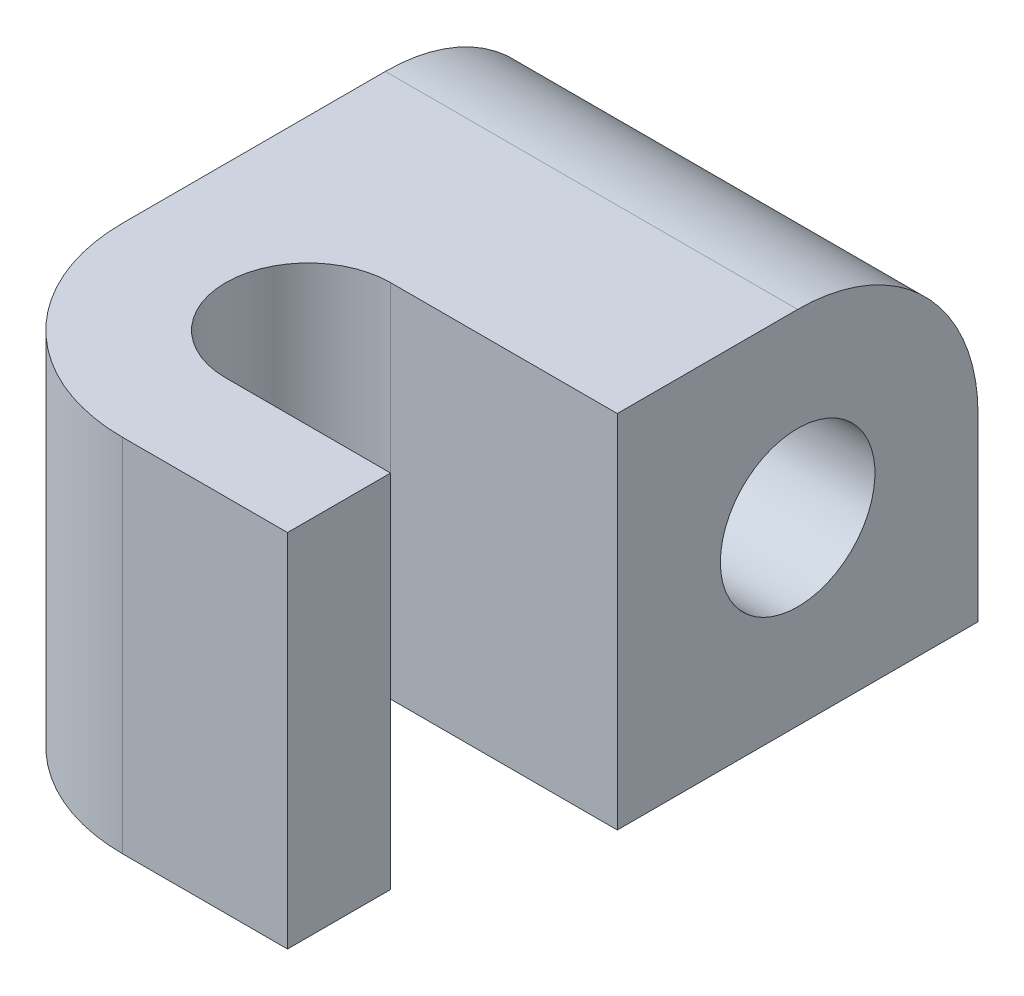
ISO-10303-21;
HEADER;
FILE_DESCRIPTION(('STEP AP214'),'2;1');
FILE_NAME('part.step','',(''),(''),'','','');
FILE_SCHEMA(('AUTOMOTIVE_DESIGN { 1 0 10303 214 1 1 1 1 }'));
ENDSEC;
DATA;
#1=APPLICATION_CONTEXT('core data for automotive mechanical design processes');
#2=APPLICATION_PROTOCOL_DEFINITION('international standard','automotive_design',2000,#1);
#3=PRODUCT_CONTEXT('',#1,'mechanical');
#4=PRODUCT('Part','Part','',(#3));
#5=PRODUCT_RELATED_PRODUCT_CATEGORY('part','',(#4));
#6=PRODUCT_DEFINITION_FORMATION('','',#4);
#7=PRODUCT_DEFINITION_CONTEXT('part definition',#1,'design');
#8=PRODUCT_DEFINITION('design','',#6,#7);
#9=PRODUCT_DEFINITION_SHAPE('','',#8);
#10=(LENGTH_UNIT() NAMED_UNIT(*) SI_UNIT(.MILLI.,.METRE.));
#11=(NAMED_UNIT(*) PLANE_ANGLE_UNIT() SI_UNIT($,.RADIAN.));
#12=(NAMED_UNIT(*) SI_UNIT($,.STERADIAN.) SOLID_ANGLE_UNIT());
#13=UNCERTAINTY_MEASURE_WITH_UNIT(LENGTH_MEASURE(1.E-05),#10,'distance_accuracy_value','');
#14=(GEOMETRIC_REPRESENTATION_CONTEXT(3) GLOBAL_UNCERTAINTY_ASSIGNED_CONTEXT((#13)) GLOBAL_UNIT_ASSIGNED_CONTEXT((#10,
#11,#12)) REPRESENTATION_CONTEXT('',''));
#15=CARTESIAN_POINT('',(0.,0.,0.));
#16=DIRECTION('',(0.,0.,1.));
#17=DIRECTION('',(1.,0.,0.));
#18=AXIS2_PLACEMENT_3D('',#15,#16,#17);
#19=CARTESIAN_POINT('',(20.,8.75,8.75));
#20=DIRECTION('',(0.,0.,-1.));
#21=DIRECTION('',(0.,1.,0.));
#22=AXIS2_PLACEMENT_3D('',#19,#20,#21);
#23=PLANE('',#22);
#24=DIRECTION('',(0.,-1.,0.));
#25=VECTOR('',#24,1.);
#26=CARTESIAN_POINT('',(9.,17.5,8.75));
#27=LINE('',#26,#25);
#28=CARTESIAN_POINT('',(9.,17.5,8.75));
#29=VERTEX_POINT('',#28);
#30=CARTESIAN_POINT('',(9.,0.,8.75));
#31=VERTEX_POINT('',#30);
#32=EDGE_CURVE('E47',#29,#31,#27,.T.);
#33=ORIENTED_EDGE('',*,*,#32,.T.);
#34=DIRECTION('',(-1.,0.,0.));
#35=VECTOR('',#34,1.);
#36=CARTESIAN_POINT('',(20.,0.,8.75));
#37=LINE('',#36,#35);
#38=CARTESIAN_POINT('',(20.,0.,8.75));
#39=VERTEX_POINT('',#38);
#40=EDGE_CURVE('E11',#39,#31,#37,.T.);
#41=ORIENTED_EDGE('',*,*,#40,.F.);
#42=DIRECTION('',(0.,-1.,0.));
#43=VECTOR('',#42,1.);
#44=CARTESIAN_POINT('',(20.,8.75,8.75));
#45=LINE('',#44,#43);
#46=CARTESIAN_POINT('',(20.,17.5,8.75));
#47=VERTEX_POINT('',#46);
#48=EDGE_CURVE('E116',#47,#39,#45,.T.);
#49=ORIENTED_EDGE('',*,*,#48,.F.);
#50=DIRECTION('',(-1.,0.,0.));
#51=VECTOR('',#50,1.);
#52=CARTESIAN_POINT('',(9.,17.5,8.75));
#53=LINE('',#52,#51);
#54=EDGE_CURVE('E143',#47,#29,#53,.T.);
#55=ORIENTED_EDGE('',*,*,#54,.T.);
#56=EDGE_LOOP('',(#33,#41,#49,#55));
#57=FACE_BOUND('',#56,.T.);
#58=ADVANCED_FACE('F33',(#57),#23,.F.);
#59=CARTESIAN_POINT('',(20.,8.75,0.));
#60=DIRECTION('',(-1.,0.,0.));
#61=DIRECTION('',(0.,0.,1.));
#62=AXIS2_PLACEMENT_3D('',#59,#60,#61);
#63=CYLINDRICAL_SURFACE('',#62,8.75);
#64=DIRECTION('',(1.,0.,0.));
#65=VECTOR('',#64,1.);
#66=CARTESIAN_POINT('',(20.,17.5,0.));
#67=LINE('',#66,#65);
#68=CARTESIAN_POINT('',(0.,17.5,0.));
#69=VERTEX_POINT('',#68);
#70=CARTESIAN_POINT('',(20.,17.5,0.));
#71=VERTEX_POINT('',#70);
#72=EDGE_CURVE('E54',#69,#71,#67,.T.);
#73=ORIENTED_EDGE('',*,*,#72,.T.);
#74=CARTESIAN_POINT('',(20.,8.75,0.));
#75=DIRECTION('',(1.,0.,0.));
#76=DIRECTION('',(0.,0.,-1.));
#77=AXIS2_PLACEMENT_3D('',#74,#75,#76);
#78=CIRCLE('',#77,8.75);
#79=CARTESIAN_POINT('',(20.,8.75,-8.75));
#80=VERTEX_POINT('',#79);
#81=EDGE_CURVE('E188',#80,#71,#78,.T.);
#82=ORIENTED_EDGE('',*,*,#81,.F.);
#83=DIRECTION('',(-1.,0.,0.));
#84=VECTOR('',#83,1.);
#85=CARTESIAN_POINT('',(20.,8.75,-8.75));
#86=LINE('',#85,#84);
#87=CARTESIAN_POINT('',(0.,8.75,-8.75));
#88=VERTEX_POINT('',#87);
#89=EDGE_CURVE('E112',#80,#88,#86,.T.);
#90=ORIENTED_EDGE('',*,*,#89,.T.);
#91=CARTESIAN_POINT('',(0.,8.75,0.));
#92=DIRECTION('',(1.,0.,0.));
#93=DIRECTION('',(0.,0.,-1.));
#94=AXIS2_PLACEMENT_3D('',#91,#92,#93);
#95=CIRCLE('',#94,8.75);
#96=EDGE_CURVE('E109',#88,#69,#95,.T.);
#97=ORIENTED_EDGE('',*,*,#96,.T.);
#98=EDGE_LOOP('',(#73,#82,#90,#97));
#99=FACE_BOUND('',#98,.T.);
#100=ADVANCED_FACE('F110',(#99),#63,.T.);
#101=CARTESIAN_POINT('',(20.,0.,8.75));
#102=DIRECTION('',(0.,1.,0.));
#103=DIRECTION('',(0.,0.,1.));
#104=AXIS2_PLACEMENT_3D('',#101,#102,#103);
#105=PLANE('',#104);
#106=DIRECTION('',(-1.,0.,0.));
#107=VECTOR('',#106,1.);
#108=CARTESIAN_POINT('',(20.,0.,-8.75));
#109=LINE('',#108,#107);
#110=CARTESIAN_POINT('',(20.,0.,-8.75));
#111=VERTEX_POINT('',#110);
#112=CARTESIAN_POINT('',(0.,0.,-8.75));
#113=VERTEX_POINT('',#112);
#114=EDGE_CURVE('E40',#111,#113,#109,.T.);
#115=ORIENTED_EDGE('',*,*,#114,.F.);
#116=DIRECTION('',(0.,0.,-1.));
#117=VECTOR('',#116,1.);
#118=CARTESIAN_POINT('',(20.,0.,8.75));
#119=LINE('',#118,#117);
#120=EDGE_CURVE('E184',#39,#111,#119,.T.);
#121=ORIENTED_EDGE('',*,*,#120,.F.);
#122=ORIENTED_EDGE('',*,*,#40,.T.);
#123=CARTESIAN_POINT('',(9.,0.,12.75));
#124=DIRECTION('',(0.,1.,0.));
#125=DIRECTION('',(0.,0.,-1.));
#126=AXIS2_PLACEMENT_3D('',#123,#124,#125);
#127=CIRCLE('',#126,4.);
#128=CARTESIAN_POINT('',(9.,0.,16.75));
#129=VERTEX_POINT('',#128);
#130=EDGE_CURVE('E159',#31,#129,#127,.T.);
#131=ORIENTED_EDGE('',*,*,#130,.T.);
#132=DIRECTION('',(1.,0.,0.));
#133=VECTOR('',#132,1.);
#134=CARTESIAN_POINT('',(17.,0.,16.75));
#135=LINE('',#134,#133);
#136=CARTESIAN_POINT('',(17.,0.,16.75));
#137=VERTEX_POINT('',#136);
#138=EDGE_CURVE('E162',#129,#137,#135,.T.);
#139=ORIENTED_EDGE('',*,*,#138,.T.);
#140=DIRECTION('',(0.,0.,1.));
#141=VECTOR('',#140,1.);
#142=CARTESIAN_POINT('',(17.,0.,21.75));
#143=LINE('',#142,#141);
#144=CARTESIAN_POINT('',(17.,0.,21.75));
#145=VERTEX_POINT('',#144);
#146=EDGE_CURVE('E166',#137,#145,#143,.T.);
#147=ORIENTED_EDGE('',*,*,#146,.T.);
#148=DIRECTION('',(-1.,0.,0.));
#149=VECTOR('',#148,1.);
#150=CARTESIAN_POINT('',(9.,0.,21.75));
#151=LINE('',#150,#149);
#152=CARTESIAN_POINT('',(9.,0.,21.75));
#153=VERTEX_POINT('',#152);
#154=EDGE_CURVE('E136',#145,#153,#151,.T.);
#155=ORIENTED_EDGE('',*,*,#154,.T.);
#156=CARTESIAN_POINT('',(9.,0.,12.75));
#157=DIRECTION('',(0.,-1.,0.));
#158=DIRECTION('',(0.,0.,1.));
#159=AXIS2_PLACEMENT_3D('',#156,#157,#158);
#160=CIRCLE('',#159,9.);
#161=CARTESIAN_POINT('',(0.,0.,12.75));
#162=VERTEX_POINT('',#161);
#163=EDGE_CURVE('E133',#153,#162,#160,.T.);
#164=ORIENTED_EDGE('',*,*,#163,.T.);
#165=DIRECTION('',(0.,0.,-1.));
#166=VECTOR('',#165,1.);
#167=CARTESIAN_POINT('',(0.,0.,8.75));
#168=LINE('',#167,#166);
#169=EDGE_CURVE('E172',#162,#113,#168,.T.);
#170=ORIENTED_EDGE('',*,*,#169,.T.);
#171=EDGE_LOOP('',(#115,#121,#122,#131,#139,#147,#155,#164,#170));
#172=FACE_BOUND('',#171,.T.);
#173=ADVANCED_FACE('F201',(#172),#105,.F.);
#174=CARTESIAN_POINT('',(20.,0.,-8.75));
#175=DIRECTION('',(0.,0.,1.));
#176=DIRECTION('',(0.,-1.,0.));
#177=AXIS2_PLACEMENT_3D('',#174,#175,#176);
#178=PLANE('',#177);
#179=DIRECTION('',(0.,1.,0.));
#180=VECTOR('',#179,1.);
#181=CARTESIAN_POINT('',(0.,0.,-8.75));
#182=LINE('',#181,#180);
#183=EDGE_CURVE('E117',#113,#88,#182,.T.);
#184=ORIENTED_EDGE('',*,*,#183,.T.);
#185=ORIENTED_EDGE('',*,*,#89,.F.);
#186=DIRECTION('',(0.,1.,0.));
#187=VECTOR('',#186,1.);
#188=CARTESIAN_POINT('',(20.,0.,-8.75));
#189=LINE('',#188,#187);
#190=EDGE_CURVE('E186',#111,#80,#189,.T.);
#191=ORIENTED_EDGE('',*,*,#190,.F.);
#192=ORIENTED_EDGE('',*,*,#114,.T.);
#193=EDGE_LOOP('',(#184,#185,#191,#192));
#194=FACE_BOUND('',#193,.T.);
#195=ADVANCED_FACE('F196',(#194),#178,.F.);
#196=CARTESIAN_POINT('',(20.,8.75,0.));
#197=DIRECTION('',(1.,0.,0.));
#198=DIRECTION('',(0.,0.,-1.));
#199=AXIS2_PLACEMENT_3D('',#196,#197,#198);
#200=PLANE('',#199);
#201=CARTESIAN_POINT('',(20.,8.75,0.));
#202=DIRECTION('',(-1.,0.,0.));
#203=DIRECTION('',(0.,0.,1.));
#204=AXIS2_PLACEMENT_3D('',#201,#202,#203);
#205=CIRCLE('',#204,3.75);
#206=CARTESIAN_POINT('',(20.,8.75,3.75));
#207=VERTEX_POINT('',#206);
#208=EDGE_CURVE('E163',#207,#207,#205,.T.);
#209=ORIENTED_EDGE('',*,*,#208,.T.);
#210=EDGE_LOOP('',(#209));
#211=FACE_BOUND('',#210,.T.);
#212=ORIENTED_EDGE('',*,*,#81,.T.);
#213=DIRECTION('',(0.,0.,1.));
#214=VECTOR('',#213,1.);
#215=CARTESIAN_POINT('',(20.,17.5,8.75));
#216=LINE('',#215,#214);
#217=EDGE_CURVE('E127',#71,#47,#216,.T.);
#218=ORIENTED_EDGE('',*,*,#217,.T.);
#219=ORIENTED_EDGE('',*,*,#48,.T.);
#220=ORIENTED_EDGE('',*,*,#120,.T.);
#221=ORIENTED_EDGE('',*,*,#190,.T.);
#222=EDGE_LOOP('',(#212,#218,#219,#220,#221));
#223=FACE_BOUND('',#222,.T.);
#224=ADVANCED_FACE('F219',(#211,#223),#200,.T.);
#225=CARTESIAN_POINT('',(0.,8.75,0.));
#226=DIRECTION('',(1.,0.,0.));
#227=DIRECTION('',(0.,0.,-1.));
#228=AXIS2_PLACEMENT_3D('',#225,#226,#227);
#229=PLANE('',#228);
#230=CARTESIAN_POINT('',(0.,8.75,0.));
#231=DIRECTION('',(-1.,0.,0.));
#232=DIRECTION('',(0.,0.,1.));
#233=AXIS2_PLACEMENT_3D('',#230,#231,#232);
#234=CIRCLE('',#233,3.75);
#235=CARTESIAN_POINT('',(0.,8.75,3.75));
#236=VERTEX_POINT('',#235);
#237=EDGE_CURVE('E139',#236,#236,#234,.T.);
#238=ORIENTED_EDGE('',*,*,#237,.F.);
#239=EDGE_LOOP('',(#238));
#240=FACE_BOUND('',#239,.T.);
#241=ORIENTED_EDGE('',*,*,#169,.F.);
#242=DIRECTION('',(0.,-1.,0.));
#243=VECTOR('',#242,1.);
#244=CARTESIAN_POINT('',(0.,17.5,12.75));
#245=LINE('',#244,#243);
#246=CARTESIAN_POINT('',(0.,17.5,12.75));
#247=VERTEX_POINT('',#246);
#248=EDGE_CURVE('E131',#247,#162,#245,.T.);
#249=ORIENTED_EDGE('',*,*,#248,.F.);
#250=DIRECTION('',(0.,0.,-1.));
#251=VECTOR('',#250,1.);
#252=CARTESIAN_POINT('',(0.,17.5,0.));
#253=LINE('',#252,#251);
#254=EDGE_CURVE('E123',#247,#69,#253,.T.);
#255=ORIENTED_EDGE('',*,*,#254,.T.);
#256=ORIENTED_EDGE('',*,*,#96,.F.);
#257=ORIENTED_EDGE('',*,*,#183,.F.);
#258=EDGE_LOOP('',(#241,#249,#255,#256,#257));
#259=FACE_BOUND('',#258,.T.);
#260=ADVANCED_FACE('F129',(#240,#259),#229,.F.);
#261=CARTESIAN_POINT('',(9.,17.5,12.75));
#262=DIRECTION('',(0.,-1.,0.));
#263=DIRECTION('',(0.,0.,-1.));
#264=AXIS2_PLACEMENT_3D('',#261,#262,#263);
#265=CYLINDRICAL_SURFACE('',#264,9.);
#266=ORIENTED_EDGE('',*,*,#163,.F.);
#267=DIRECTION('',(0.,-1.,0.));
#268=VECTOR('',#267,1.);
#269=CARTESIAN_POINT('',(9.,17.5,21.75));
#270=LINE('',#269,#268);
#271=CARTESIAN_POINT('',(9.,17.5,21.75));
#272=VERTEX_POINT('',#271);
#273=EDGE_CURVE('E173',#272,#153,#270,.T.);
#274=ORIENTED_EDGE('',*,*,#273,.F.);
#275=CARTESIAN_POINT('',(9.,17.5,12.75));
#276=DIRECTION('',(0.,-1.,0.));
#277=DIRECTION('',(0.,0.,1.));
#278=AXIS2_PLACEMENT_3D('',#275,#276,#277);
#279=CIRCLE('',#278,9.);
#280=EDGE_CURVE('E157',#272,#247,#279,.T.);
#281=ORIENTED_EDGE('',*,*,#280,.T.);
#282=ORIENTED_EDGE('',*,*,#248,.T.);
#283=EDGE_LOOP('',(#266,#274,#281,#282));
#284=FACE_BOUND('',#283,.T.);
#285=ADVANCED_FACE('F200',(#284),#265,.T.);
#286=CARTESIAN_POINT('',(9.,17.5,21.75));
#287=DIRECTION('',(0.,0.,1.));
#288=DIRECTION('',(1.,0.,0.));
#289=AXIS2_PLACEMENT_3D('',#286,#287,#288);
#290=PLANE('',#289);
#291=ORIENTED_EDGE('',*,*,#154,.F.);
#292=DIRECTION('',(0.,-1.,0.));
#293=VECTOR('',#292,1.);
#294=CARTESIAN_POINT('',(17.,17.5,21.75));
#295=LINE('',#294,#293);
#296=CARTESIAN_POINT('',(17.,17.5,21.75));
#297=VERTEX_POINT('',#296);
#298=EDGE_CURVE('E175',#297,#145,#295,.T.);
#299=ORIENTED_EDGE('',*,*,#298,.F.);
#300=DIRECTION('',(-1.,0.,0.));
#301=VECTOR('',#300,1.);
#302=CARTESIAN_POINT('',(9.,17.5,21.75));
#303=LINE('',#302,#301);
#304=EDGE_CURVE('E154',#297,#272,#303,.T.);
#305=ORIENTED_EDGE('',*,*,#304,.T.);
#306=ORIENTED_EDGE('',*,*,#273,.T.);
#307=EDGE_LOOP('',(#291,#299,#305,#306));
#308=FACE_BOUND('',#307,.T.);
#309=ADVANCED_FACE('F205',(#308),#290,.T.);
#310=CARTESIAN_POINT('',(17.,17.5,21.75));
#311=DIRECTION('',(1.,0.,0.));
#312=DIRECTION('',(0.,0.,-1.));
#313=AXIS2_PLACEMENT_3D('',#310,#311,#312);
#314=PLANE('',#313);
#315=ORIENTED_EDGE('',*,*,#146,.F.);
#316=DIRECTION('',(0.,-1.,0.));
#317=VECTOR('',#316,1.);
#318=CARTESIAN_POINT('',(17.,17.5,16.75));
#319=LINE('',#318,#317);
#320=CARTESIAN_POINT('',(17.,17.5,16.75));
#321=VERTEX_POINT('',#320);
#322=EDGE_CURVE('E177',#321,#137,#319,.T.);
#323=ORIENTED_EDGE('',*,*,#322,.F.);
#324=DIRECTION('',(0.,0.,1.));
#325=VECTOR('',#324,1.);
#326=CARTESIAN_POINT('',(17.,17.5,21.75));
#327=LINE('',#326,#325);
#328=EDGE_CURVE('E151',#321,#297,#327,.T.);
#329=ORIENTED_EDGE('',*,*,#328,.T.);
#330=ORIENTED_EDGE('',*,*,#298,.T.);
#331=EDGE_LOOP('',(#315,#323,#329,#330));
#332=FACE_BOUND('',#331,.T.);
#333=ADVANCED_FACE('F210',(#332),#314,.T.);
#334=CARTESIAN_POINT('',(17.,17.5,16.75));
#335=DIRECTION('',(0.,0.,-1.));
#336=DIRECTION('',(-1.,0.,0.));
#337=AXIS2_PLACEMENT_3D('',#334,#335,#336);
#338=PLANE('',#337);
#339=ORIENTED_EDGE('',*,*,#138,.F.);
#340=DIRECTION('',(0.,-1.,0.));
#341=VECTOR('',#340,1.);
#342=CARTESIAN_POINT('',(9.,17.5,16.75));
#343=LINE('',#342,#341);
#344=CARTESIAN_POINT('',(9.,17.5,16.75));
#345=VERTEX_POINT('',#344);
#346=EDGE_CURVE('E179',#345,#129,#343,.T.);
#347=ORIENTED_EDGE('',*,*,#346,.F.);
#348=DIRECTION('',(1.,0.,0.));
#349=VECTOR('',#348,1.);
#350=CARTESIAN_POINT('',(17.,17.5,16.75));
#351=LINE('',#350,#349);
#352=EDGE_CURVE('E148',#345,#321,#351,.T.);
#353=ORIENTED_EDGE('',*,*,#352,.T.);
#354=ORIENTED_EDGE('',*,*,#322,.T.);
#355=EDGE_LOOP('',(#339,#347,#353,#354));
#356=FACE_BOUND('',#355,.T.);
#357=ADVANCED_FACE('F213',(#356),#338,.T.);
#358=CARTESIAN_POINT('',(9.,17.5,12.75));
#359=DIRECTION('',(0.,-1.,0.));
#360=DIRECTION('',(0.,0.,-1.));
#361=AXIS2_PLACEMENT_3D('',#358,#359,#360);
#362=CYLINDRICAL_SURFACE('',#361,4.);
#363=ORIENTED_EDGE('',*,*,#130,.F.);
#364=ORIENTED_EDGE('',*,*,#32,.F.);
#365=CARTESIAN_POINT('',(9.,17.5,12.75));
#366=DIRECTION('',(0.,1.,0.));
#367=DIRECTION('',(0.,0.,-1.));
#368=AXIS2_PLACEMENT_3D('',#365,#366,#367);
#369=CIRCLE('',#368,4.);
#370=EDGE_CURVE('E145',#29,#345,#369,.T.);
#371=ORIENTED_EDGE('',*,*,#370,.T.);
#372=ORIENTED_EDGE('',*,*,#346,.T.);
#373=EDGE_LOOP('',(#363,#364,#371,#372));
#374=FACE_BOUND('',#373,.T.);
#375=ADVANCED_FACE('F217',(#374),#362,.F.);
#376=CARTESIAN_POINT('',(9.,17.5,12.75));
#377=DIRECTION('',(0.,1.,0.));
#378=DIRECTION('',(0.,0.,1.));
#379=AXIS2_PLACEMENT_3D('',#376,#377,#378);
#380=PLANE('',#379);
#381=ORIENTED_EDGE('',*,*,#254,.F.);
#382=ORIENTED_EDGE('',*,*,#280,.F.);
#383=ORIENTED_EDGE('',*,*,#304,.F.);
#384=ORIENTED_EDGE('',*,*,#328,.F.);
#385=ORIENTED_EDGE('',*,*,#352,.F.);
#386=ORIENTED_EDGE('',*,*,#370,.F.);
#387=ORIENTED_EDGE('',*,*,#54,.F.);
#388=ORIENTED_EDGE('',*,*,#217,.F.);
#389=ORIENTED_EDGE('',*,*,#72,.F.);
#390=EDGE_LOOP('',(#381,#382,#383,#384,#385,#386,#387,#388,#389));
#391=FACE_BOUND('',#390,.T.);
#392=ADVANCED_FACE('F121',(#391),#380,.T.);
#393=CARTESIAN_POINT('',(20.,8.75,0.));
#394=DIRECTION('',(-1.,0.,0.));
#395=DIRECTION('',(0.,0.,1.));
#396=AXIS2_PLACEMENT_3D('',#393,#394,#395);
#397=CYLINDRICAL_SURFACE('',#396,3.75);
#398=ORIENTED_EDGE('',*,*,#208,.F.);
#399=EDGE_LOOP('',(#398));
#400=FACE_BOUND('',#399,.T.);
#401=ORIENTED_EDGE('',*,*,#237,.T.);
#402=EDGE_LOOP('',(#401));
#403=FACE_BOUND('',#402,.T.);
#404=ADVANCED_FACE('F294',(#400,#403),#397,.F.);
#405=CLOSED_SHELL('',(#58,#100,#173,#195,#224,#260,#285,#309,#333,#357,#375,#392,#404));
#406=MANIFOLD_SOLID_BREP('B2',#405);
#407=ADVANCED_BREP_SHAPE_REPRESENTATION('',(#18,#406),#14);
#408=SHAPE_DEFINITION_REPRESENTATION(#9,#407);
ENDSEC;
END-ISO-10303-21;
